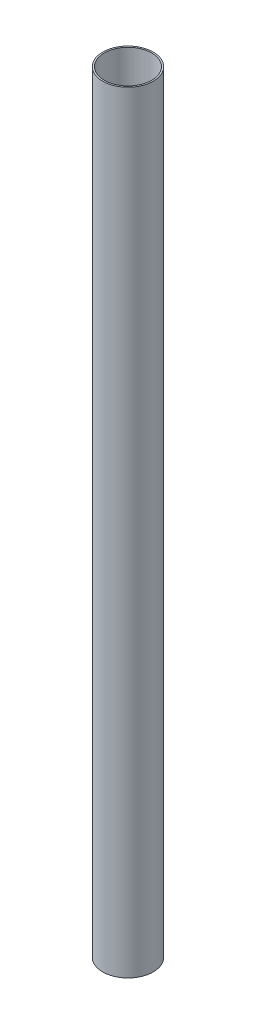
ISO-10303-21;
HEADER;
FILE_DESCRIPTION(('STEP AP214'),'2;1');
FILE_NAME('part.step','',(''),(''),'','','');
FILE_SCHEMA(('AUTOMOTIVE_DESIGN { 1 0 10303 214 1 1 1 1 }'));
ENDSEC;
DATA;
#1=APPLICATION_CONTEXT('core data for automotive mechanical design processes');
#2=APPLICATION_PROTOCOL_DEFINITION('international standard','automotive_design',2000,#1);
#3=PRODUCT_CONTEXT('',#1,'mechanical');
#4=PRODUCT('Part','Part','',(#3));
#5=PRODUCT_RELATED_PRODUCT_CATEGORY('part','',(#4));
#6=PRODUCT_DEFINITION_FORMATION('','',#4);
#7=PRODUCT_DEFINITION_CONTEXT('part definition',#1,'design');
#8=PRODUCT_DEFINITION('design','',#6,#7);
#9=PRODUCT_DEFINITION_SHAPE('','',#8);
#10=(LENGTH_UNIT() NAMED_UNIT(*) SI_UNIT(.MILLI.,.METRE.));
#11=(NAMED_UNIT(*) PLANE_ANGLE_UNIT() SI_UNIT($,.RADIAN.));
#12=(NAMED_UNIT(*) SI_UNIT($,.STERADIAN.) SOLID_ANGLE_UNIT());
#13=UNCERTAINTY_MEASURE_WITH_UNIT(LENGTH_MEASURE(1.E-05),#10,'distance_accuracy_value','');
#14=(GEOMETRIC_REPRESENTATION_CONTEXT(3) GLOBAL_UNCERTAINTY_ASSIGNED_CONTEXT((#13)) GLOBAL_UNIT_ASSIGNED_CONTEXT((#10,
#11,#12)) REPRESENTATION_CONTEXT('',''));
#15=CARTESIAN_POINT('',(0.,0.,0.));
#16=DIRECTION('',(0.,0.,1.));
#17=DIRECTION('',(1.,0.,0.));
#18=AXIS2_PLACEMENT_3D('',#15,#16,#17);
#19=CARTESIAN_POINT('',(0.,971.076988117962,0.));
#20=DIRECTION('',(0.,-1.,0.));
#21=DIRECTION('',(0.,0.,-1.));
#22=AXIS2_PLACEMENT_3D('',#19,#20,#21);
#23=CYLINDRICAL_SURFACE('',#22,29.1084);
#24=CARTESIAN_POINT('',(0.,0.,0.));
#25=DIRECTION('',(0.,1.,0.));
#26=DIRECTION('',(0.,0.,1.));
#27=AXIS2_PLACEMENT_3D('',#24,#25,#26);
#28=CIRCLE('',#27,29.1084);
#29=CARTESIAN_POINT('',(0.,0.,29.1084));
#30=VERTEX_POINT('',#29);
#31=EDGE_CURVE('E40',#30,#30,#28,.T.);
#32=ORIENTED_EDGE('',*,*,#31,.T.);
#33=EDGE_LOOP('',(#32));
#34=FACE_BOUND('',#33,.T.);
#35=CARTESIAN_POINT('',(0.,888.746,0.));
#36=DIRECTION('',(0.,1.,0.));
#37=DIRECTION('',(0.,0.,1.));
#38=AXIS2_PLACEMENT_3D('',#35,#36,#37);
#39=CIRCLE('',#38,29.1084);
#40=CARTESIAN_POINT('',(0.,888.746,29.1084));
#41=VERTEX_POINT('',#40);
#42=EDGE_CURVE('E44',#41,#41,#39,.T.);
#43=ORIENTED_EDGE('',*,*,#42,.F.);
#44=EDGE_LOOP('',(#43));
#45=FACE_BOUND('',#44,.T.);
#46=ADVANCED_FACE('F37',(#34,#45),#23,.T.);
#47=CARTESIAN_POINT('',(0.,0.,0.));
#48=DIRECTION('',(0.,1.,0.));
#49=DIRECTION('',(0.,0.,1.));
#50=AXIS2_PLACEMENT_3D('',#47,#48,#49);
#51=PLANE('',#50);
#52=ORIENTED_EDGE('',*,*,#31,.F.);
#53=EDGE_LOOP('',(#52));
#54=FACE_BOUND('',#53,.T.);
#55=CARTESIAN_POINT('',(0.,0.,0.));
#56=DIRECTION('',(0.,1.,0.));
#57=DIRECTION('',(0.,0.,1.));
#58=AXIS2_PLACEMENT_3D('',#55,#56,#57);
#59=CIRCLE('',#58,27.3304);
#60=CARTESIAN_POINT('',(0.,0.,27.3304));
#61=VERTEX_POINT('',#60);
#62=EDGE_CURVE('E50',#61,#61,#59,.T.);
#63=ORIENTED_EDGE('',*,*,#62,.T.);
#64=EDGE_LOOP('',(#63));
#65=FACE_BOUND('',#64,.T.);
#66=ADVANCED_FACE('F59',(#54,#65),#51,.F.);
#67=CARTESIAN_POINT('',(0.,971.076988117962,0.));
#68=DIRECTION('',(0.,-1.,0.));
#69=DIRECTION('',(0.,0.,-1.));
#70=AXIS2_PLACEMENT_3D('',#67,#68,#69);
#71=CYLINDRICAL_SURFACE('',#70,27.3304);
#72=ORIENTED_EDGE('',*,*,#62,.F.);
#73=EDGE_LOOP('',(#72));
#74=FACE_BOUND('',#73,.T.);
#75=CARTESIAN_POINT('',(0.,888.746,0.));
#76=DIRECTION('',(0.,1.,0.));
#77=DIRECTION('',(0.,0.,1.));
#78=AXIS2_PLACEMENT_3D('',#75,#76,#77);
#79=CIRCLE('',#78,27.3304);
#80=CARTESIAN_POINT('',(0.,888.746,27.3304));
#81=VERTEX_POINT('',#80);
#82=EDGE_CURVE('E10',#81,#81,#79,.T.);
#83=ORIENTED_EDGE('',*,*,#82,.T.);
#84=EDGE_LOOP('',(#83));
#85=FACE_BOUND('',#84,.T.);
#86=ADVANCED_FACE('F61',(#74,#85),#71,.F.);
#87=CARTESIAN_POINT('',(0.,888.746,0.));
#88=DIRECTION('',(0.,1.,0.));
#89=DIRECTION('',(0.,0.,1.));
#90=AXIS2_PLACEMENT_3D('',#87,#88,#89);
#91=PLANE('',#90);
#92=ORIENTED_EDGE('',*,*,#42,.T.);
#93=EDGE_LOOP('',(#92));
#94=FACE_BOUND('',#93,.T.);
#95=ORIENTED_EDGE('',*,*,#82,.F.);
#96=EDGE_LOOP('',(#95));
#97=FACE_BOUND('',#96,.T.);
#98=ADVANCED_FACE('F66',(#94,#97),#91,.T.);
#99=CLOSED_SHELL('',(#46,#66,#86,#98));
#100=MANIFOLD_SOLID_BREP('B2',#99);
#101=ADVANCED_BREP_SHAPE_REPRESENTATION('',(#18,#100),#14);
#102=SHAPE_DEFINITION_REPRESENTATION(#9,#101);
ENDSEC;
END-ISO-10303-21;
